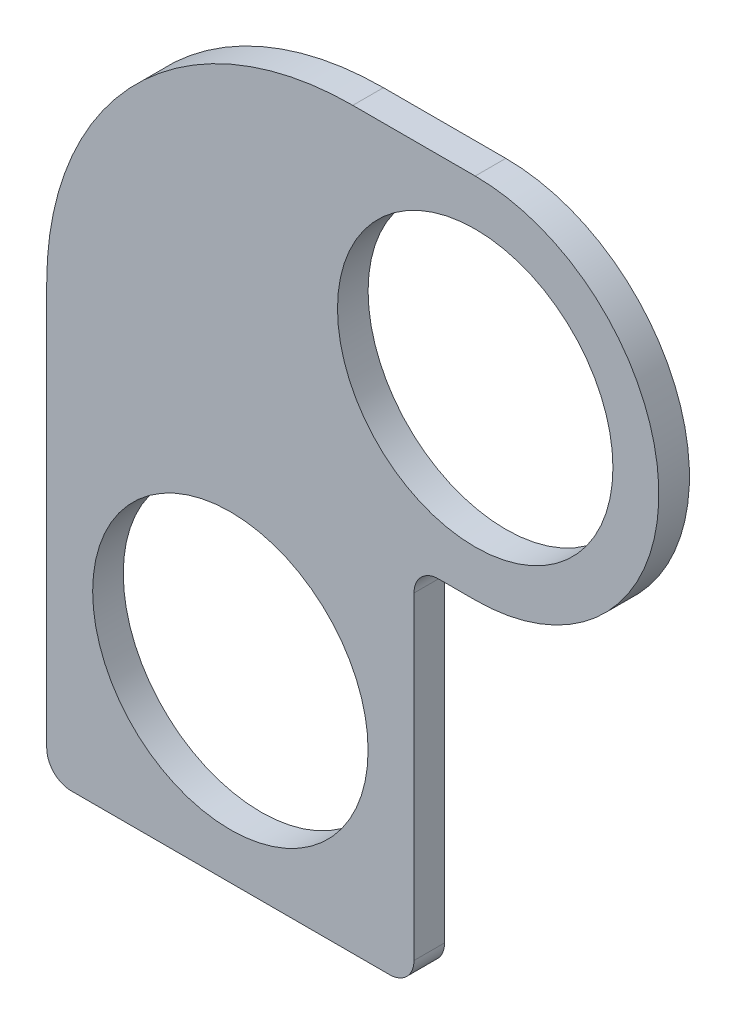
ISO-10303-21;
HEADER;
FILE_DESCRIPTION(('STEP AP214'),'2;1');
FILE_NAME('part.step','',(''),(''),'','','');
FILE_SCHEMA(('AUTOMOTIVE_DESIGN { 1 0 10303 214 1 1 1 1 }'));
ENDSEC;
DATA;
#1=APPLICATION_CONTEXT('core data for automotive mechanical design processes');
#2=APPLICATION_PROTOCOL_DEFINITION('international standard','automotive_design',2000,#1);
#3=PRODUCT_CONTEXT('',#1,'mechanical');
#4=PRODUCT('Part','Part','',(#3));
#5=PRODUCT_RELATED_PRODUCT_CATEGORY('part','',(#4));
#6=PRODUCT_DEFINITION_FORMATION('','',#4);
#7=PRODUCT_DEFINITION_CONTEXT('part definition',#1,'design');
#8=PRODUCT_DEFINITION('design','',#6,#7);
#9=PRODUCT_DEFINITION_SHAPE('','',#8);
#10=(LENGTH_UNIT() NAMED_UNIT(*) SI_UNIT(.MILLI.,.METRE.));
#11=(NAMED_UNIT(*) PLANE_ANGLE_UNIT() SI_UNIT($,.RADIAN.));
#12=(NAMED_UNIT(*) SI_UNIT($,.STERADIAN.) SOLID_ANGLE_UNIT());
#13=UNCERTAINTY_MEASURE_WITH_UNIT(LENGTH_MEASURE(1.E-05),#10,'distance_accuracy_value','');
#14=(GEOMETRIC_REPRESENTATION_CONTEXT(3) GLOBAL_UNCERTAINTY_ASSIGNED_CONTEXT((#13)) GLOBAL_UNIT_ASSIGNED_CONTEXT((#10,
#11,#12)) REPRESENTATION_CONTEXT('',''));
#15=CARTESIAN_POINT('',(0.,0.,0.));
#16=DIRECTION('',(0.,0.,1.));
#17=DIRECTION('',(1.,0.,0.));
#18=AXIS2_PLACEMENT_3D('',#15,#16,#17);
#19=CARTESIAN_POINT('',(25.4,0.,3.175));
#20=DIRECTION('',(0.,0.,1.));
#21=DIRECTION('',(1.,0.,0.));
#22=AXIS2_PLACEMENT_3D('',#19,#20,#21);
#23=PLANE('',#22);
#24=CARTESIAN_POINT('',(0.,-38.1,3.175));
#25=DIRECTION('',(0.,0.,1.));
#26=DIRECTION('',(1.,0.,0.));
#27=AXIS2_PLACEMENT_3D('',#24,#25,#26);
#28=CIRCLE('',#27,14.2875);
#29=CARTESIAN_POINT('',(14.2875,-38.1,3.175));
#30=VERTEX_POINT('',#29);
#31=EDGE_CURVE('E212',#30,#30,#28,.T.);
#32=ORIENTED_EDGE('',*,*,#31,.F.);
#33=EDGE_LOOP('',(#32));
#34=FACE_BOUND('',#33,.T.);
#35=DIRECTION('',(0.,-1.,0.));
#36=VECTOR('',#35,1.);
#37=CARTESIAN_POINT('',(-19.05,-19.05,3.175));
#38=LINE('',#37,#36);
#39=CARTESIAN_POINT('',(-19.05,-12.7000000000002,3.175));
#40=VERTEX_POINT('',#39);
#41=CARTESIAN_POINT('',(-19.05,-54.61,3.175));
#42=VERTEX_POINT('',#41);
#43=EDGE_CURVE('E234',#40,#42,#38,.T.);
#44=ORIENTED_EDGE('',*,*,#43,.T.);
#45=CARTESIAN_POINT('',(-16.51,-54.61,3.175));
#46=DIRECTION('',(0.,0.,1.));
#47=DIRECTION('',(1.,0.,0.));
#48=AXIS2_PLACEMENT_3D('',#45,#46,#47);
#49=CIRCLE('',#48,2.54);
#50=CARTESIAN_POINT('',(-16.51,-57.15,3.175));
#51=VERTEX_POINT('',#50);
#52=EDGE_CURVE('E169',#42,#51,#49,.T.);
#53=ORIENTED_EDGE('',*,*,#52,.T.);
#54=DIRECTION('',(1.,0.,0.));
#55=VECTOR('',#54,1.);
#56=CARTESIAN_POINT('',(19.05,-57.15,3.175));
#57=LINE('',#56,#55);
#58=CARTESIAN_POINT('',(16.51,-57.15,3.175));
#59=VERTEX_POINT('',#58);
#60=EDGE_CURVE('E205',#51,#59,#57,.T.);
#61=ORIENTED_EDGE('',*,*,#60,.T.);
#62=CARTESIAN_POINT('',(16.51,-54.61,3.175));
#63=DIRECTION('',(0.,0.,1.));
#64=DIRECTION('',(1.,0.,0.));
#65=AXIS2_PLACEMENT_3D('',#62,#63,#64);
#66=CIRCLE('',#65,2.54);
#67=CARTESIAN_POINT('',(19.05,-54.61,3.175));
#68=VERTEX_POINT('',#67);
#69=EDGE_CURVE('E166',#59,#68,#66,.T.);
#70=ORIENTED_EDGE('',*,*,#69,.T.);
#71=DIRECTION('',(0.,1.,0.));
#72=VECTOR('',#71,1.);
#73=CARTESIAN_POINT('',(19.05,-19.05,3.175));
#74=LINE('',#73,#72);
#75=CARTESIAN_POINT('',(19.05,-21.59,3.175));
#76=VERTEX_POINT('',#75);
#77=EDGE_CURVE('E200',#68,#76,#74,.T.);
#78=ORIENTED_EDGE('',*,*,#77,.T.);
#79=CARTESIAN_POINT('',(21.59,-21.59,3.175));
#80=DIRECTION('',(0.,0.,1.));
#81=DIRECTION('',(1.,0.,0.));
#82=AXIS2_PLACEMENT_3D('',#79,#80,#81);
#83=CIRCLE('',#82,2.54);
#84=CARTESIAN_POINT('',(21.59,-19.05,3.175));
#85=VERTEX_POINT('',#84);
#86=EDGE_CURVE('E11',#76,#85,#83,.F.);
#87=ORIENTED_EDGE('',*,*,#86,.T.);
#88=DIRECTION('',(1.,0.,0.));
#89=VECTOR('',#88,1.);
#90=CARTESIAN_POINT('',(25.4,-19.05,3.175));
#91=LINE('',#90,#89);
#92=CARTESIAN_POINT('',(25.4,-19.05,3.175));
#93=VERTEX_POINT('',#92);
#94=EDGE_CURVE('E133',#85,#93,#91,.T.);
#95=ORIENTED_EDGE('',*,*,#94,.T.);
#96=CARTESIAN_POINT('',(25.4,0.,3.175));
#97=DIRECTION('',(0.,0.,1.));
#98=DIRECTION('',(1.,0.,0.));
#99=AXIS2_PLACEMENT_3D('',#96,#97,#98);
#100=CIRCLE('',#99,19.05);
#101=CARTESIAN_POINT('',(25.4,19.05,3.175));
#102=VERTEX_POINT('',#101);
#103=EDGE_CURVE('E128',#93,#102,#100,.T.);
#104=ORIENTED_EDGE('',*,*,#103,.T.);
#105=DIRECTION('',(-1.,0.,0.));
#106=VECTOR('',#105,1.);
#107=CARTESIAN_POINT('',(12.7000000000002,19.05,3.175));
#108=LINE('',#107,#106);
#109=CARTESIAN_POINT('',(12.7000000000002,19.05,3.175));
#110=VERTEX_POINT('',#109);
#111=EDGE_CURVE('E117',#102,#110,#108,.T.);
#112=ORIENTED_EDGE('',*,*,#111,.T.);
#113=CARTESIAN_POINT('',(12.7,-12.7,3.175));
#114=DIRECTION('',(0.,0.,1.));
#115=DIRECTION('',(-1.,0.,0.));
#116=AXIS2_PLACEMENT_3D('',#113,#114,#115);
#117=CIRCLE('',#116,31.75);
#118=EDGE_CURVE('E127',#110,#40,#117,.T.);
#119=ORIENTED_EDGE('',*,*,#118,.T.);
#120=EDGE_LOOP('',(#44,#53,#61,#70,#78,#87,#95,#104,#112,#119));
#121=FACE_BOUND('',#120,.T.);
#122=CARTESIAN_POINT('',(25.4,0.,3.175));
#123=DIRECTION('',(0.,0.,1.));
#124=DIRECTION('',(1.,0.,0.));
#125=AXIS2_PLACEMENT_3D('',#122,#123,#124);
#126=CIRCLE('',#125,14.2875);
#127=CARTESIAN_POINT('',(39.6875,0.,3.175));
#128=VERTEX_POINT('',#127);
#129=EDGE_CURVE('E258',#128,#128,#126,.T.);
#130=ORIENTED_EDGE('',*,*,#129,.F.);
#131=EDGE_LOOP('',(#130));
#132=FACE_BOUND('',#131,.T.);
#133=ADVANCED_FACE('F39',(#34,#121,#132),#23,.T.);
#134=CARTESIAN_POINT('',(25.4,0.,0.));
#135=DIRECTION('',(0.,0.,1.));
#136=DIRECTION('',(1.,0.,0.));
#137=AXIS2_PLACEMENT_3D('',#134,#135,#136);
#138=PLANE('',#137);
#139=DIRECTION('',(1.,0.,0.));
#140=VECTOR('',#139,1.);
#141=CARTESIAN_POINT('',(19.05,-57.15,0.));
#142=LINE('',#141,#140);
#143=CARTESIAN_POINT('',(-16.51,-57.15,0.));
#144=VERTEX_POINT('',#143);
#145=CARTESIAN_POINT('',(16.51,-57.15,0.));
#146=VERTEX_POINT('',#145);
#147=EDGE_CURVE('E194',#144,#146,#142,.T.);
#148=ORIENTED_EDGE('',*,*,#147,.F.);
#149=CARTESIAN_POINT('',(-16.51,-54.61,0.));
#150=DIRECTION('',(0.,0.,1.));
#151=DIRECTION('',(1.,0.,0.));
#152=AXIS2_PLACEMENT_3D('',#149,#150,#151);
#153=CIRCLE('',#152,2.54);
#154=CARTESIAN_POINT('',(-19.05,-54.61,0.));
#155=VERTEX_POINT('',#154);
#156=EDGE_CURVE('E160',#144,#155,#153,.F.);
#157=ORIENTED_EDGE('',*,*,#156,.T.);
#158=DIRECTION('',(0.,-1.,0.));
#159=VECTOR('',#158,1.);
#160=CARTESIAN_POINT('',(-19.05,-57.15,0.));
#161=LINE('',#160,#159);
#162=CARTESIAN_POINT('',(-19.05,-12.7000000000002,0.));
#163=VERTEX_POINT('',#162);
#164=EDGE_CURVE('E219',#163,#155,#161,.T.);
#165=ORIENTED_EDGE('',*,*,#164,.F.);
#166=CARTESIAN_POINT('',(12.7,-12.7,0.));
#167=DIRECTION('',(0.,0.,1.));
#168=DIRECTION('',(-1.,0.,0.));
#169=AXIS2_PLACEMENT_3D('',#166,#167,#168);
#170=CIRCLE('',#169,31.75);
#171=CARTESIAN_POINT('',(12.7000000000002,19.05,0.));
#172=VERTEX_POINT('',#171);
#173=EDGE_CURVE('E215',#172,#163,#170,.T.);
#174=ORIENTED_EDGE('',*,*,#173,.F.);
#175=DIRECTION('',(-1.,0.,0.));
#176=VECTOR('',#175,1.);
#177=CARTESIAN_POINT('',(12.7000000000002,19.05,0.));
#178=LINE('',#177,#176);
#179=CARTESIAN_POINT('',(25.4,19.05,0.));
#180=VERTEX_POINT('',#179);
#181=EDGE_CURVE('E211',#180,#172,#178,.T.);
#182=ORIENTED_EDGE('',*,*,#181,.F.);
#183=CARTESIAN_POINT('',(25.4,0.,0.));
#184=DIRECTION('',(0.,0.,1.));
#185=DIRECTION('',(1.,0.,0.));
#186=AXIS2_PLACEMENT_3D('',#183,#184,#185);
#187=CIRCLE('',#186,19.05);
#188=CARTESIAN_POINT('',(25.4,-19.05,0.));
#189=VERTEX_POINT('',#188);
#190=EDGE_CURVE('E142',#189,#180,#187,.T.);
#191=ORIENTED_EDGE('',*,*,#190,.F.);
#192=DIRECTION('',(1.,0.,0.));
#193=VECTOR('',#192,1.);
#194=CARTESIAN_POINT('',(25.4,-19.05,0.));
#195=LINE('',#194,#193);
#196=CARTESIAN_POINT('',(21.59,-19.05,0.));
#197=VERTEX_POINT('',#196);
#198=EDGE_CURVE('E138',#197,#189,#195,.T.);
#199=ORIENTED_EDGE('',*,*,#198,.F.);
#200=CARTESIAN_POINT('',(21.59,-21.59,0.));
#201=DIRECTION('',(0.,0.,1.));
#202=DIRECTION('',(1.,0.,0.));
#203=AXIS2_PLACEMENT_3D('',#200,#201,#202);
#204=CIRCLE('',#203,2.54);
#205=CARTESIAN_POINT('',(19.05,-21.59,0.));
#206=VERTEX_POINT('',#205);
#207=EDGE_CURVE('E48',#197,#206,#204,.T.);
#208=ORIENTED_EDGE('',*,*,#207,.T.);
#209=DIRECTION('',(0.,1.,0.));
#210=VECTOR('',#209,1.);
#211=CARTESIAN_POINT('',(19.05,-19.05,0.));
#212=LINE('',#211,#210);
#213=CARTESIAN_POINT('',(19.05,-54.61,0.));
#214=VERTEX_POINT('',#213);
#215=EDGE_CURVE('E188',#214,#206,#212,.T.);
#216=ORIENTED_EDGE('',*,*,#215,.F.);
#217=CARTESIAN_POINT('',(16.51,-54.61,0.));
#218=DIRECTION('',(0.,0.,1.));
#219=DIRECTION('',(1.,0.,0.));
#220=AXIS2_PLACEMENT_3D('',#217,#218,#219);
#221=CIRCLE('',#220,2.54);
#222=EDGE_CURVE('E157',#214,#146,#221,.F.);
#223=ORIENTED_EDGE('',*,*,#222,.T.);
#224=EDGE_LOOP('',(#148,#157,#165,#174,#182,#191,#199,#208,#216,#223));
#225=FACE_BOUND('',#224,.T.);
#226=CARTESIAN_POINT('',(0.,-38.1,0.));
#227=DIRECTION('',(0.,0.,1.));
#228=DIRECTION('',(1.,0.,0.));
#229=AXIS2_PLACEMENT_3D('',#226,#227,#228);
#230=CIRCLE('',#229,14.2875);
#231=CARTESIAN_POINT('',(14.2875,-38.1,0.));
#232=VERTEX_POINT('',#231);
#233=EDGE_CURVE('E254',#232,#232,#230,.T.);
#234=ORIENTED_EDGE('',*,*,#233,.T.);
#235=EDGE_LOOP('',(#234));
#236=FACE_BOUND('',#235,.T.);
#237=CARTESIAN_POINT('',(25.4,0.,0.));
#238=DIRECTION('',(0.,0.,1.));
#239=DIRECTION('',(1.,0.,0.));
#240=AXIS2_PLACEMENT_3D('',#237,#238,#239);
#241=CIRCLE('',#240,14.2875);
#242=CARTESIAN_POINT('',(39.6875,0.,0.));
#243=VERTEX_POINT('',#242);
#244=EDGE_CURVE('E262',#243,#243,#241,.T.);
#245=ORIENTED_EDGE('',*,*,#244,.T.);
#246=EDGE_LOOP('',(#245));
#247=FACE_BOUND('',#246,.T.);
#248=ADVANCED_FACE('F186',(#225,#236,#247),#138,.F.);
#249=CARTESIAN_POINT('',(25.4,0.,3.175));
#250=DIRECTION('',(0.,0.,-1.));
#251=DIRECTION('',(-1.,0.,0.));
#252=AXIS2_PLACEMENT_3D('',#249,#250,#251);
#253=CYLINDRICAL_SURFACE('',#252,19.05);
#254=ORIENTED_EDGE('',*,*,#190,.T.);
#255=DIRECTION('',(0.,0.,-1.));
#256=VECTOR('',#255,1.);
#257=CARTESIAN_POINT('',(25.4,19.05,3.175));
#258=LINE('',#257,#256);
#259=EDGE_CURVE('E121',#102,#180,#258,.T.);
#260=ORIENTED_EDGE('',*,*,#259,.F.);
#261=ORIENTED_EDGE('',*,*,#103,.F.);
#262=DIRECTION('',(0.,0.,-1.));
#263=VECTOR('',#262,1.);
#264=CARTESIAN_POINT('',(25.4,-19.05,3.175));
#265=LINE('',#264,#263);
#266=EDGE_CURVE('E198',#93,#189,#265,.T.);
#267=ORIENTED_EDGE('',*,*,#266,.T.);
#268=EDGE_LOOP('',(#254,#260,#261,#267));
#269=FACE_BOUND('',#268,.T.);
#270=ADVANCED_FACE('F140',(#269),#253,.T.);
#271=CARTESIAN_POINT('',(12.7000000000002,19.05,3.175));
#272=DIRECTION('',(0.,-1.,0.));
#273=DIRECTION('',(0.,0.,-1.));
#274=AXIS2_PLACEMENT_3D('',#271,#272,#273);
#275=PLANE('',#274);
#276=ORIENTED_EDGE('',*,*,#181,.T.);
#277=DIRECTION('',(0.,0.,-1.));
#278=VECTOR('',#277,1.);
#279=CARTESIAN_POINT('',(12.7000000000002,19.05,3.175));
#280=LINE('',#279,#278);
#281=EDGE_CURVE('E124',#110,#172,#280,.T.);
#282=ORIENTED_EDGE('',*,*,#281,.F.);
#283=ORIENTED_EDGE('',*,*,#111,.F.);
#284=ORIENTED_EDGE('',*,*,#259,.T.);
#285=EDGE_LOOP('',(#276,#282,#283,#284));
#286=FACE_BOUND('',#285,.T.);
#287=ADVANCED_FACE('F119',(#286),#275,.F.);
#288=CARTESIAN_POINT('',(12.7,-12.7,3.175));
#289=DIRECTION('',(0.,0.,-1.));
#290=DIRECTION('',(-1.,0.,0.));
#291=AXIS2_PLACEMENT_3D('',#288,#289,#290);
#292=CYLINDRICAL_SURFACE('',#291,31.75);
#293=ORIENTED_EDGE('',*,*,#173,.T.);
#294=DIRECTION('',(0.,0.,-1.));
#295=VECTOR('',#294,1.);
#296=CARTESIAN_POINT('',(-19.05,-12.7000000000002,3.175));
#297=LINE('',#296,#295);
#298=EDGE_CURVE('E150',#40,#163,#297,.T.);
#299=ORIENTED_EDGE('',*,*,#298,.F.);
#300=ORIENTED_EDGE('',*,*,#118,.F.);
#301=ORIENTED_EDGE('',*,*,#281,.T.);
#302=EDGE_LOOP('',(#293,#299,#300,#301));
#303=FACE_BOUND('',#302,.T.);
#304=ADVANCED_FACE('F236',(#303),#292,.T.);
#305=CARTESIAN_POINT('',(-19.05,-57.15,3.175));
#306=DIRECTION('',(1.,0.,0.));
#307=DIRECTION('',(0.,1.,0.));
#308=AXIS2_PLACEMENT_3D('',#305,#306,#307);
#309=PLANE('',#308);
#310=ORIENTED_EDGE('',*,*,#164,.T.);
#311=DIRECTION('',(0.,0.,-1.));
#312=VECTOR('',#311,1.);
#313=CARTESIAN_POINT('',(-19.05,-54.61,3.175));
#314=LINE('',#313,#312);
#315=EDGE_CURVE('E163',#155,#42,#314,.F.);
#316=ORIENTED_EDGE('',*,*,#315,.T.);
#317=ORIENTED_EDGE('',*,*,#43,.F.);
#318=ORIENTED_EDGE('',*,*,#298,.T.);
#319=EDGE_LOOP('',(#310,#316,#317,#318));
#320=FACE_BOUND('',#319,.T.);
#321=ADVANCED_FACE('F232',(#320),#309,.F.);
#322=CARTESIAN_POINT('',(19.05,-57.15,3.175));
#323=DIRECTION('',(0.,1.,0.));
#324=DIRECTION('',(-1.,0.,0.));
#325=AXIS2_PLACEMENT_3D('',#322,#323,#324);
#326=PLANE('',#325);
#327=ORIENTED_EDGE('',*,*,#60,.F.);
#328=DIRECTION('',(0.,0.,-1.));
#329=VECTOR('',#328,1.);
#330=CARTESIAN_POINT('',(-16.51,-57.15,3.175));
#331=LINE('',#330,#329);
#332=EDGE_CURVE('E148',#51,#144,#331,.T.);
#333=ORIENTED_EDGE('',*,*,#332,.T.);
#334=ORIENTED_EDGE('',*,*,#147,.T.);
#335=DIRECTION('',(0.,0.,-1.));
#336=VECTOR('',#335,1.);
#337=CARTESIAN_POINT('',(16.51,-57.15,3.175));
#338=LINE('',#337,#336);
#339=EDGE_CURVE('E144',#146,#59,#338,.F.);
#340=ORIENTED_EDGE('',*,*,#339,.T.);
#341=EDGE_LOOP('',(#327,#333,#334,#340));
#342=FACE_BOUND('',#341,.T.);
#343=ADVANCED_FACE('F244',(#342),#326,.F.);
#344=CARTESIAN_POINT('',(19.05,-19.05,3.175));
#345=DIRECTION('',(-1.,0.,0.));
#346=DIRECTION('',(0.,-1.,0.));
#347=AXIS2_PLACEMENT_3D('',#344,#345,#346);
#348=PLANE('',#347);
#349=ORIENTED_EDGE('',*,*,#77,.F.);
#350=DIRECTION('',(0.,0.,-1.));
#351=VECTOR('',#350,1.);
#352=CARTESIAN_POINT('',(19.05,-54.61,3.175));
#353=LINE('',#352,#351);
#354=EDGE_CURVE('E174',#68,#214,#353,.T.);
#355=ORIENTED_EDGE('',*,*,#354,.T.);
#356=ORIENTED_EDGE('',*,*,#215,.T.);
#357=DIRECTION('',(0.,0.,-1.));
#358=VECTOR('',#357,1.);
#359=CARTESIAN_POINT('',(19.05,-21.59,3.175));
#360=LINE('',#359,#358);
#361=EDGE_CURVE('E61',#206,#76,#360,.F.);
#362=ORIENTED_EDGE('',*,*,#361,.T.);
#363=EDGE_LOOP('',(#349,#355,#356,#362));
#364=FACE_BOUND('',#363,.T.);
#365=ADVANCED_FACE('F191',(#364),#348,.F.);
#366=CARTESIAN_POINT('',(25.4,-19.05,3.175));
#367=DIRECTION('',(0.,1.,0.));
#368=DIRECTION('',(-1.,0.,0.));
#369=AXIS2_PLACEMENT_3D('',#366,#367,#368);
#370=PLANE('',#369);
#371=ORIENTED_EDGE('',*,*,#94,.F.);
#372=DIRECTION('',(0.,0.,-1.));
#373=VECTOR('',#372,1.);
#374=CARTESIAN_POINT('',(21.59,-19.05,0.));
#375=LINE('',#374,#373);
#376=EDGE_CURVE('E178',#85,#197,#375,.T.);
#377=ORIENTED_EDGE('',*,*,#376,.T.);
#378=ORIENTED_EDGE('',*,*,#198,.T.);
#379=ORIENTED_EDGE('',*,*,#266,.F.);
#380=EDGE_LOOP('',(#371,#377,#378,#379));
#381=FACE_BOUND('',#380,.T.);
#382=ADVANCED_FACE('F197',(#381),#370,.F.);
#383=CARTESIAN_POINT('',(0.,-38.1,3.175));
#384=DIRECTION('',(0.,0.,-1.));
#385=DIRECTION('',(-1.,0.,0.));
#386=AXIS2_PLACEMENT_3D('',#383,#384,#385);
#387=CYLINDRICAL_SURFACE('',#386,14.2875);
#388=ORIENTED_EDGE('',*,*,#31,.T.);
#389=EDGE_LOOP('',(#388));
#390=FACE_BOUND('',#389,.T.);
#391=ORIENTED_EDGE('',*,*,#233,.F.);
#392=EDGE_LOOP('',(#391));
#393=FACE_BOUND('',#392,.T.);
#394=ADVANCED_FACE('F281',(#390,#393),#387,.F.);
#395=CARTESIAN_POINT('',(25.4,0.,3.175));
#396=DIRECTION('',(0.,0.,-1.));
#397=DIRECTION('',(-1.,0.,0.));
#398=AXIS2_PLACEMENT_3D('',#395,#396,#397);
#399=CYLINDRICAL_SURFACE('',#398,14.2875);
#400=ORIENTED_EDGE('',*,*,#129,.T.);
#401=EDGE_LOOP('',(#400));
#402=FACE_BOUND('',#401,.T.);
#403=ORIENTED_EDGE('',*,*,#244,.F.);
#404=EDGE_LOOP('',(#403));
#405=FACE_BOUND('',#404,.T.);
#406=ADVANCED_FACE('F270',(#402,#405),#399,.F.);
#407=CARTESIAN_POINT('',(-16.51,-54.61,3.175));
#408=DIRECTION('',(0.,0.,-1.));
#409=DIRECTION('',(-1.,0.,0.));
#410=AXIS2_PLACEMENT_3D('',#407,#408,#409);
#411=CYLINDRICAL_SURFACE('',#410,2.54);
#412=ORIENTED_EDGE('',*,*,#52,.F.);
#413=ORIENTED_EDGE('',*,*,#315,.F.);
#414=ORIENTED_EDGE('',*,*,#156,.F.);
#415=ORIENTED_EDGE('',*,*,#332,.F.);
#416=EDGE_LOOP('',(#412,#413,#414,#415));
#417=FACE_BOUND('',#416,.T.);
#418=ADVANCED_FACE('F241',(#417),#411,.T.);
#419=CARTESIAN_POINT('',(16.51,-54.61,3.175));
#420=DIRECTION('',(0.,0.,-1.));
#421=DIRECTION('',(-1.,0.,0.));
#422=AXIS2_PLACEMENT_3D('',#419,#420,#421);
#423=CYLINDRICAL_SURFACE('',#422,2.54);
#424=ORIENTED_EDGE('',*,*,#69,.F.);
#425=ORIENTED_EDGE('',*,*,#339,.F.);
#426=ORIENTED_EDGE('',*,*,#222,.F.);
#427=ORIENTED_EDGE('',*,*,#354,.F.);
#428=EDGE_LOOP('',(#424,#425,#426,#427));
#429=FACE_BOUND('',#428,.T.);
#430=ADVANCED_FACE('F299',(#429),#423,.T.);
#431=CARTESIAN_POINT('',(21.59,-21.59,3.175));
#432=DIRECTION('',(0.,0.,1.));
#433=DIRECTION('',(1.,0.,0.));
#434=AXIS2_PLACEMENT_3D('',#431,#432,#433);
#435=CYLINDRICAL_SURFACE('',#434,2.54);
#436=ORIENTED_EDGE('',*,*,#86,.F.);
#437=ORIENTED_EDGE('',*,*,#361,.F.);
#438=ORIENTED_EDGE('',*,*,#207,.F.);
#439=ORIENTED_EDGE('',*,*,#376,.F.);
#440=EDGE_LOOP('',(#436,#437,#438,#439));
#441=FACE_BOUND('',#440,.T.);
#442=ADVANCED_FACE('F41',(#441),#435,.F.);
#443=CLOSED_SHELL('',(#133,#248,#270,#287,#304,#321,#343,#365,#382,#394,#406,#418,#430,#442));
#444=MANIFOLD_SOLID_BREP('B2',#443);
#445=ADVANCED_BREP_SHAPE_REPRESENTATION('',(#18,#444),#14);
#446=SHAPE_DEFINITION_REPRESENTATION(#9,#445);
ENDSEC;
END-ISO-10303-21;
